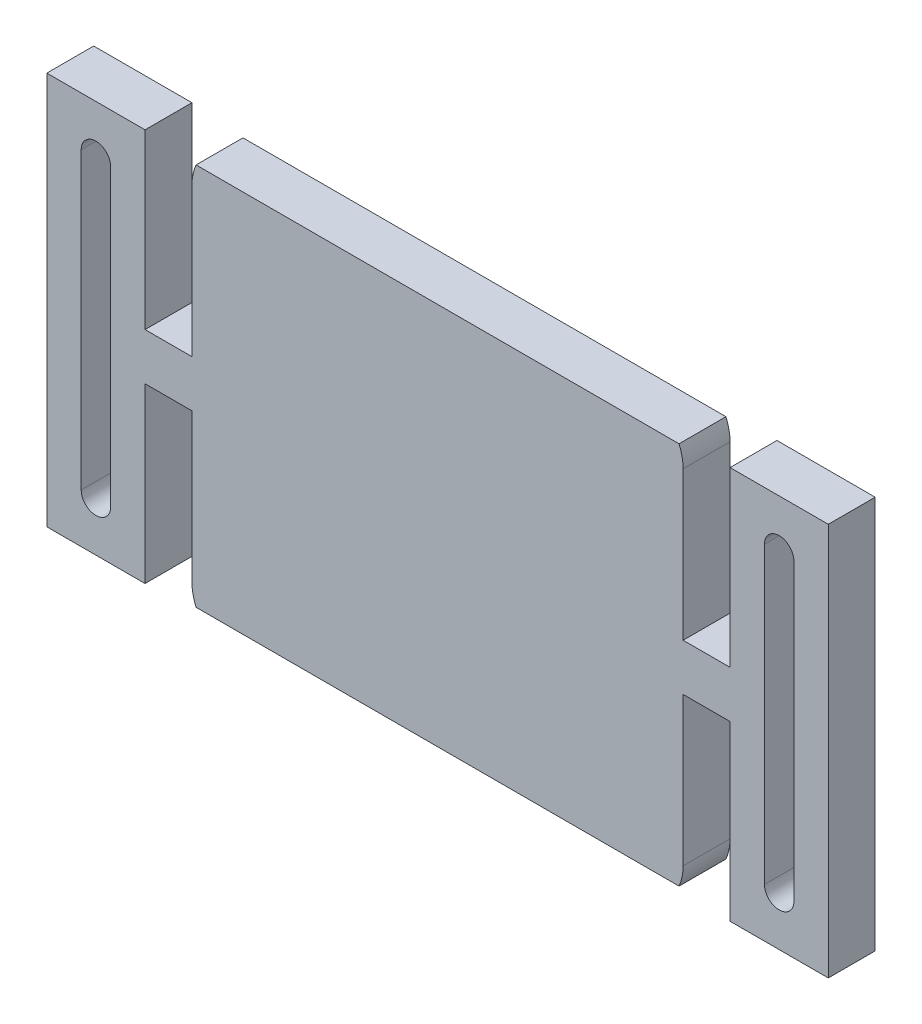
ISO-10303-21;
HEADER;
FILE_DESCRIPTION(('STEP AP214'),'2;1');
FILE_NAME('part.step','',(''),(''),'','','');
FILE_SCHEMA(('AUTOMOTIVE_DESIGN { 1 0 10303 214 1 1 1 1 }'));
ENDSEC;
DATA;
#1=APPLICATION_CONTEXT('core data for automotive mechanical design processes');
#2=APPLICATION_PROTOCOL_DEFINITION('international standard','automotive_design',2000,#1);
#3=PRODUCT_CONTEXT('',#1,'mechanical');
#4=PRODUCT('Part','Part','',(#3));
#5=PRODUCT_RELATED_PRODUCT_CATEGORY('part','',(#4));
#6=PRODUCT_DEFINITION_FORMATION('','',#4);
#7=PRODUCT_DEFINITION_CONTEXT('part definition',#1,'design');
#8=PRODUCT_DEFINITION('design','',#6,#7);
#9=PRODUCT_DEFINITION_SHAPE('','',#8);
#10=(LENGTH_UNIT() NAMED_UNIT(*) SI_UNIT(.MILLI.,.METRE.));
#11=(NAMED_UNIT(*) PLANE_ANGLE_UNIT() SI_UNIT($,.RADIAN.));
#12=(NAMED_UNIT(*) SI_UNIT($,.STERADIAN.) SOLID_ANGLE_UNIT());
#13=UNCERTAINTY_MEASURE_WITH_UNIT(LENGTH_MEASURE(1.E-05),#10,'distance_accuracy_value','');
#14=(GEOMETRIC_REPRESENTATION_CONTEXT(3) GLOBAL_UNCERTAINTY_ASSIGNED_CONTEXT((#13)) GLOBAL_UNIT_ASSIGNED_CONTEXT((#10,
#11,#12)) REPRESENTATION_CONTEXT('',''));
#15=CARTESIAN_POINT('',(0.,0.,0.));
#16=DIRECTION('',(0.,0.,1.));
#17=DIRECTION('',(1.,0.,0.));
#18=AXIS2_PLACEMENT_3D('',#15,#16,#17);
#19=CARTESIAN_POINT('',(0.,0.,0.));
#20=DIRECTION('',(0.,0.,1.));
#21=DIRECTION('',(1.,0.,0.));
#22=AXIS2_PLACEMENT_3D('',#19,#20,#21);
#23=PLANE('',#22);
#24=DIRECTION('',(1.,0.,0.));
#25=VECTOR('',#24,1.);
#26=CARTESIAN_POINT('',(0.,42.,0.));
#27=LINE('',#26,#25);
#28=CARTESIAN_POINT('',(-54.3577756949558,42.,0.));
#29=VERTEX_POINT('',#28);
#30=CARTESIAN_POINT('',(-5.19262430504416,42.,0.));
#31=VERTEX_POINT('',#30);
#32=EDGE_CURVE('E480',#29,#31,#27,.T.);
#33=ORIENTED_EDGE('',*,*,#32,.T.);
#34=CARTESIAN_POINT('',(-9.7752,40.,0.));
#35=DIRECTION('',(0.,0.,1.));
#36=DIRECTION('',(1.,0.,0.));
#37=AXIS2_PLACEMENT_3D('',#34,#35,#36);
#38=CIRCLE('',#37,5.);
#39=CARTESIAN_POINT('',(-4.7752,40.,0.));
#40=VERTEX_POINT('',#39);
#41=EDGE_CURVE('E494',#40,#31,#38,.T.);
#42=ORIENTED_EDGE('',*,*,#41,.F.);
#43=DIRECTION('',(0.,-1.,0.));
#44=VECTOR('',#43,1.);
#45=CARTESIAN_POINT('',(-4.7752,0.,0.));
#46=LINE('',#45,#44);
#47=CARTESIAN_POINT('',(-4.7752,24.8875999999999,0.));
#48=VERTEX_POINT('',#47);
#49=EDGE_CURVE('E504',#40,#48,#46,.T.);
#50=ORIENTED_EDGE('',*,*,#49,.T.);
#51=DIRECTION('',(1.,0.,0.));
#52=VECTOR('',#51,1.);
#53=CARTESIAN_POINT('',(-4.7752,24.8875999999999,0.));
#54=LINE('',#53,#52);
#55=CARTESIAN_POINT('',(0.,24.8875999999999,0.));
#56=VERTEX_POINT('',#55);
#57=EDGE_CURVE('E577',#48,#56,#54,.T.);
#58=ORIENTED_EDGE('',*,*,#57,.T.);
#59=DIRECTION('',(0.,1.,0.));
#60=VECTOR('',#59,1.);
#61=CARTESIAN_POINT('',(0.,2.49999999999995,0.));
#62=LINE('',#61,#60);
#63=CARTESIAN_POINT('',(0.,42.4999999999999,0.));
#64=VERTEX_POINT('',#63);
#65=EDGE_CURVE('E617',#56,#64,#62,.T.);
#66=ORIENTED_EDGE('',*,*,#65,.T.);
#67=DIRECTION('',(1.,0.,0.));
#68=VECTOR('',#67,1.);
#69=CARTESIAN_POINT('',(0.,42.4999999999999,0.));
#70=LINE('',#69,#68);
#71=CARTESIAN_POINT('',(10.,42.4999999999999,0.));
#72=VERTEX_POINT('',#71);
#73=EDGE_CURVE('E613',#64,#72,#70,.T.);
#74=ORIENTED_EDGE('',*,*,#73,.T.);
#75=DIRECTION('',(0.,1.,0.));
#76=VECTOR('',#75,1.);
#77=CARTESIAN_POINT('',(9.99999999999997,2.49999999999993,0.));
#78=LINE('',#77,#76);
#79=CARTESIAN_POINT('',(9.99999999999997,2.49999999999993,0.));
#80=VERTEX_POINT('',#79);
#81=EDGE_CURVE('E609',#80,#72,#78,.T.);
#82=ORIENTED_EDGE('',*,*,#81,.F.);
#83=DIRECTION('',(-1.,0.,0.));
#84=VECTOR('',#83,1.);
#85=CARTESIAN_POINT('',(4.99999999999996,2.49999999999995,0.));
#86=LINE('',#85,#84);
#87=CARTESIAN_POINT('',(0.,2.49999999999995,0.));
#88=VERTEX_POINT('',#87);
#89=EDGE_CURVE('E596',#80,#88,#86,.T.);
#90=ORIENTED_EDGE('',*,*,#89,.T.);
#91=CARTESIAN_POINT('',(0.,20.1123999999999,0.));
#92=VERTEX_POINT('',#91);
#93=EDGE_CURVE('E618',#88,#92,#62,.T.);
#94=ORIENTED_EDGE('',*,*,#93,.T.);
#95=DIRECTION('',(1.,0.,0.));
#96=VECTOR('',#95,1.);
#97=CARTESIAN_POINT('',(-4.7752,20.1123999999999,0.));
#98=LINE('',#97,#96);
#99=CARTESIAN_POINT('',(-4.7752,20.1123999999999,0.));
#100=VERTEX_POINT('',#99);
#101=EDGE_CURVE('E572',#100,#92,#98,.T.);
#102=ORIENTED_EDGE('',*,*,#101,.F.);
#103=CARTESIAN_POINT('',(-4.7752,5.00000000000006,0.));
#104=VERTEX_POINT('',#103);
#105=EDGE_CURVE('E510',#100,#104,#46,.T.);
#106=ORIENTED_EDGE('',*,*,#105,.T.);
#107=CARTESIAN_POINT('',(-9.7752,5.00000000000003,0.));
#108=DIRECTION('',(0.,0.,1.));
#109=DIRECTION('',(1.,0.,0.));
#110=AXIS2_PLACEMENT_3D('',#107,#108,#109);
#111=CIRCLE('',#110,5.);
#112=CARTESIAN_POINT('',(-5.19262430504425,2.99999999999982,0.));
#113=VERTEX_POINT('',#112);
#114=EDGE_CURVE('E559',#113,#104,#111,.T.);
#115=ORIENTED_EDGE('',*,*,#114,.F.);
#116=DIRECTION('',(1.,0.,0.));
#117=VECTOR('',#116,1.);
#118=CARTESIAN_POINT('',(0.,2.99999999999981,0.));
#119=LINE('',#118,#117);
#120=CARTESIAN_POINT('',(-54.3577756949559,2.99999999999987,0.));
#121=VERTEX_POINT('',#120);
#122=EDGE_CURVE('E287',#121,#113,#119,.T.);
#123=ORIENTED_EDGE('',*,*,#122,.F.);
#124=CARTESIAN_POINT('',(-49.7752,5.00000000000003,0.));
#125=DIRECTION('',(0.,0.,1.));
#126=DIRECTION('',(1.,0.,0.));
#127=AXIS2_PLACEMENT_3D('',#124,#125,#126);
#128=CIRCLE('',#127,5.);
#129=CARTESIAN_POINT('',(-54.7752,5.00000000000003,0.));
#130=VERTEX_POINT('',#129);
#131=EDGE_CURVE('E518',#130,#121,#128,.T.);
#132=ORIENTED_EDGE('',*,*,#131,.F.);
#133=DIRECTION('',(0.,1.,0.));
#134=VECTOR('',#133,1.);
#135=CARTESIAN_POINT('',(-54.7752,0.,0.));
#136=LINE('',#135,#134);
#137=CARTESIAN_POINT('',(-54.7752,20.1123999999999,0.));
#138=VERTEX_POINT('',#137);
#139=EDGE_CURVE('E514',#130,#138,#136,.T.);
#140=ORIENTED_EDGE('',*,*,#139,.T.);
#141=DIRECTION('',(1.,0.,0.));
#142=VECTOR('',#141,1.);
#143=CARTESIAN_POINT('',(-59.5504,20.1123999999999,0.));
#144=LINE('',#143,#142);
#145=CARTESIAN_POINT('',(-59.5504,20.1123999999999,0.));
#146=VERTEX_POINT('',#145);
#147=EDGE_CURVE('E543',#146,#138,#144,.T.);
#148=ORIENTED_EDGE('',*,*,#147,.F.);
#149=DIRECTION('',(0.,1.,0.));
#150=VECTOR('',#149,1.);
#151=CARTESIAN_POINT('',(-59.5504,2.49999999999995,0.));
#152=LINE('',#151,#150);
#153=CARTESIAN_POINT('',(-59.5504,2.49999999999995,0.));
#154=VERTEX_POINT('',#153);
#155=EDGE_CURVE('E665',#154,#146,#152,.T.);
#156=ORIENTED_EDGE('',*,*,#155,.F.);
#157=DIRECTION('',(1.,0.,0.));
#158=VECTOR('',#157,1.);
#159=CARTESIAN_POINT('',(-64.5504,2.49999999999995,0.));
#160=LINE('',#159,#158);
#161=CARTESIAN_POINT('',(-69.5504,2.49999999999995,0.));
#162=VERTEX_POINT('',#161);
#163=EDGE_CURVE('E643',#162,#154,#160,.T.);
#164=ORIENTED_EDGE('',*,*,#163,.F.);
#165=DIRECTION('',(0.,1.,0.));
#166=VECTOR('',#165,1.);
#167=CARTESIAN_POINT('',(-69.5504,2.49999999999995,0.));
#168=LINE('',#167,#166);
#169=CARTESIAN_POINT('',(-69.5504,42.5,0.));
#170=VERTEX_POINT('',#169);
#171=EDGE_CURVE('E656',#162,#170,#168,.T.);
#172=ORIENTED_EDGE('',*,*,#171,.T.);
#173=DIRECTION('',(-1.,0.,0.));
#174=VECTOR('',#173,1.);
#175=CARTESIAN_POINT('',(-59.5504,42.5,0.));
#176=LINE('',#175,#174);
#177=CARTESIAN_POINT('',(-59.5504,42.5,0.));
#178=VERTEX_POINT('',#177);
#179=EDGE_CURVE('E660',#178,#170,#176,.T.);
#180=ORIENTED_EDGE('',*,*,#179,.F.);
#181=CARTESIAN_POINT('',(-59.5504,24.8875999999999,0.));
#182=VERTEX_POINT('',#181);
#183=EDGE_CURVE('E664',#182,#178,#152,.T.);
#184=ORIENTED_EDGE('',*,*,#183,.F.);
#185=DIRECTION('',(1.,0.,0.));
#186=VECTOR('',#185,1.);
#187=CARTESIAN_POINT('',(-59.5504,24.8875999999999,0.));
#188=LINE('',#187,#186);
#189=CARTESIAN_POINT('',(-54.7752,24.8875999999999,0.));
#190=VERTEX_POINT('',#189);
#191=EDGE_CURVE('E548',#182,#190,#188,.T.);
#192=ORIENTED_EDGE('',*,*,#191,.T.);
#193=CARTESIAN_POINT('',(-54.7752,40.,0.));
#194=VERTEX_POINT('',#193);
#195=EDGE_CURVE('E508',#190,#194,#136,.T.);
#196=ORIENTED_EDGE('',*,*,#195,.T.);
#197=CARTESIAN_POINT('',(-49.7752,40.,0.));
#198=DIRECTION('',(0.,0.,1.));
#199=DIRECTION('',(1.,0.,0.));
#200=AXIS2_PLACEMENT_3D('',#197,#198,#199);
#201=CIRCLE('',#200,5.);
#202=EDGE_CURVE('E497',#29,#194,#201,.T.);
#203=ORIENTED_EDGE('',*,*,#202,.F.);
#204=EDGE_LOOP('',(#33,#42,#50,#58,#66,#74,#82,#90,#94,#102,#106,#115,#123,#132,#140,#148,#156,
#164,#172,#180,#184,#192,#196,#203));
#205=FACE_BOUND('',#204,.T.);
#206=DIRECTION('',(0.,-1.,0.));
#207=VECTOR('',#206,1.);
#208=CARTESIAN_POINT('',(-66.0504,0.,0.));
#209=LINE('',#208,#207);
#210=CARTESIAN_POINT('',(-66.0504,37.5,0.));
#211=VERTEX_POINT('',#210);
#212=CARTESIAN_POINT('',(-66.0504,7.49999999999994,0.));
#213=VERTEX_POINT('',#212);
#214=EDGE_CURVE('E808',#211,#213,#209,.T.);
#215=ORIENTED_EDGE('',*,*,#214,.T.);
#216=CARTESIAN_POINT('',(-64.5504,7.49999999999994,0.));
#217=DIRECTION('',(0.,0.,1.));
#218=DIRECTION('',(1.,0.,0.));
#219=AXIS2_PLACEMENT_3D('',#216,#217,#218);
#220=CIRCLE('',#219,1.5);
#221=CARTESIAN_POINT('',(-63.0504,7.49999999999994,0.));
#222=VERTEX_POINT('',#221);
#223=EDGE_CURVE('E804',#222,#213,#220,.F.);
#224=ORIENTED_EDGE('',*,*,#223,.F.);
#225=DIRECTION('',(0.,-1.,0.));
#226=VECTOR('',#225,1.);
#227=CARTESIAN_POINT('',(-63.0504,0.,0.));
#228=LINE('',#227,#226);
#229=CARTESIAN_POINT('',(-63.0504,37.5,0.));
#230=VERTEX_POINT('',#229);
#231=EDGE_CURVE('E800',#230,#222,#228,.T.);
#232=ORIENTED_EDGE('',*,*,#231,.F.);
#233=CARTESIAN_POINT('',(-64.5504,37.5,0.));
#234=DIRECTION('',(0.,0.,1.));
#235=DIRECTION('',(1.,0.,0.));
#236=AXIS2_PLACEMENT_3D('',#233,#234,#235);
#237=CIRCLE('',#236,1.5);
#238=EDGE_CURVE('E796',#230,#211,#237,.T.);
#239=ORIENTED_EDGE('',*,*,#238,.T.);
#240=EDGE_LOOP('',(#215,#224,#232,#239));
#241=FACE_BOUND('',#240,.T.);
#242=CARTESIAN_POINT('',(4.99999999999996,7.49999999999994,0.));
#243=DIRECTION('',(0.,0.,1.));
#244=DIRECTION('',(1.,0.,0.));
#245=AXIS2_PLACEMENT_3D('',#242,#243,#244);
#246=CIRCLE('',#245,1.49999999999998);
#247=CARTESIAN_POINT('',(3.49999999999997,7.49999999999994,0.));
#248=VERTEX_POINT('',#247);
#249=CARTESIAN_POINT('',(6.49999999999995,7.49999999999994,0.));
#250=VERTEX_POINT('',#249);
#251=EDGE_CURVE('E837',#248,#250,#246,.T.);
#252=ORIENTED_EDGE('',*,*,#251,.T.);
#253=DIRECTION('',(0.,-1.,0.));
#254=VECTOR('',#253,1.);
#255=CARTESIAN_POINT('',(6.49999999999996,0.,0.));
#256=LINE('',#255,#254);
#257=CARTESIAN_POINT('',(6.49999999999998,37.4999999999999,0.));
#258=VERTEX_POINT('',#257);
#259=EDGE_CURVE('E849',#258,#250,#256,.T.);
#260=ORIENTED_EDGE('',*,*,#259,.F.);
#261=CARTESIAN_POINT('',(4.99999999999999,37.4999999999999,0.));
#262=DIRECTION('',(0.,0.,1.));
#263=DIRECTION('',(1.,0.,0.));
#264=AXIS2_PLACEMENT_3D('',#261,#262,#263);
#265=CIRCLE('',#264,1.49999999999998);
#266=CARTESIAN_POINT('',(3.5,37.4999999999999,0.));
#267=VERTEX_POINT('',#266);
#268=EDGE_CURVE('E845',#267,#258,#265,.F.);
#269=ORIENTED_EDGE('',*,*,#268,.F.);
#270=DIRECTION('',(0.,-1.,0.));
#271=VECTOR('',#270,1.);
#272=CARTESIAN_POINT('',(3.49999999999995,0.,0.));
#273=LINE('',#272,#271);
#274=EDGE_CURVE('E841',#267,#248,#273,.T.);
#275=ORIENTED_EDGE('',*,*,#274,.T.);
#276=EDGE_LOOP('',(#252,#260,#269,#275));
#277=FACE_BOUND('',#276,.T.);
#278=ADVANCED_FACE('F269',(#205,#241,#277),#23,.F.);
#279=CARTESIAN_POINT('',(0.,0.,4.7752));
#280=DIRECTION('',(0.,0.,1.));
#281=DIRECTION('',(1.,0.,0.));
#282=AXIS2_PLACEMENT_3D('',#279,#280,#281);
#283=PLANE('',#282);
#284=DIRECTION('',(0.,-1.,0.));
#285=VECTOR('',#284,1.);
#286=CARTESIAN_POINT('',(6.49999999999996,0.,4.7752));
#287=LINE('',#286,#285);
#288=CARTESIAN_POINT('',(6.49999999999998,37.4999999999999,4.7752));
#289=VERTEX_POINT('',#288);
#290=CARTESIAN_POINT('',(6.49999999999996,7.49999999999994,4.7752));
#291=VERTEX_POINT('',#290);
#292=EDGE_CURVE('E833',#289,#291,#287,.T.);
#293=ORIENTED_EDGE('',*,*,#292,.T.);
#294=CARTESIAN_POINT('',(4.99999999999996,7.49999999999994,4.7752));
#295=DIRECTION('',(0.,0.,1.));
#296=DIRECTION('',(1.,0.,0.));
#297=AXIS2_PLACEMENT_3D('',#294,#295,#296);
#298=CIRCLE('',#297,1.49999999999998);
#299=CARTESIAN_POINT('',(3.49999999999998,7.49999999999994,4.7752));
#300=VERTEX_POINT('',#299);
#301=EDGE_CURVE('E822',#300,#291,#298,.T.);
#302=ORIENTED_EDGE('',*,*,#301,.F.);
#303=DIRECTION('',(0.,-1.,0.));
#304=VECTOR('',#303,1.);
#305=CARTESIAN_POINT('',(3.49999999999995,0.,4.7752));
#306=LINE('',#305,#304);
#307=CARTESIAN_POINT('',(3.5,37.4999999999999,4.7752));
#308=VERTEX_POINT('',#307);
#309=EDGE_CURVE('E825',#308,#300,#306,.T.);
#310=ORIENTED_EDGE('',*,*,#309,.F.);
#311=CARTESIAN_POINT('',(4.99999999999999,37.4999999999999,4.7752));
#312=DIRECTION('',(0.,0.,1.));
#313=DIRECTION('',(1.,0.,0.));
#314=AXIS2_PLACEMENT_3D('',#311,#312,#313);
#315=CIRCLE('',#314,1.49999999999998);
#316=EDGE_CURVE('E829',#308,#289,#315,.F.);
#317=ORIENTED_EDGE('',*,*,#316,.T.);
#318=EDGE_LOOP('',(#293,#302,#310,#317));
#319=FACE_BOUND('',#318,.T.);
#320=CARTESIAN_POINT('',(-64.5504,7.49999999999994,4.7752));
#321=DIRECTION('',(0.,0.,1.));
#322=DIRECTION('',(1.,0.,0.));
#323=AXIS2_PLACEMENT_3D('',#320,#321,#322);
#324=CIRCLE('',#323,1.5);
#325=CARTESIAN_POINT('',(-63.0504,7.49999999999994,4.7752));
#326=VERTEX_POINT('',#325);
#327=CARTESIAN_POINT('',(-66.0504,7.49999999999994,4.7752));
#328=VERTEX_POINT('',#327);
#329=EDGE_CURVE('E789',#326,#328,#324,.F.);
#330=ORIENTED_EDGE('',*,*,#329,.T.);
#331=DIRECTION('',(0.,-1.,0.));
#332=VECTOR('',#331,1.);
#333=CARTESIAN_POINT('',(-66.0504,0.,4.7752));
#334=LINE('',#333,#332);
#335=CARTESIAN_POINT('',(-66.0504,37.5,4.7752));
#336=VERTEX_POINT('',#335);
#337=EDGE_CURVE('E793',#336,#328,#334,.T.);
#338=ORIENTED_EDGE('',*,*,#337,.F.);
#339=CARTESIAN_POINT('',(-64.5504,37.5,4.7752));
#340=DIRECTION('',(0.,0.,1.));
#341=DIRECTION('',(1.,0.,0.));
#342=AXIS2_PLACEMENT_3D('',#339,#340,#341);
#343=CIRCLE('',#342,1.5);
#344=CARTESIAN_POINT('',(-63.0504,37.5,4.7752));
#345=VERTEX_POINT('',#344);
#346=EDGE_CURVE('E782',#345,#336,#343,.T.);
#347=ORIENTED_EDGE('',*,*,#346,.F.);
#348=DIRECTION('',(0.,-1.,0.));
#349=VECTOR('',#348,1.);
#350=CARTESIAN_POINT('',(-63.0504,0.,4.7752));
#351=LINE('',#350,#349);
#352=EDGE_CURVE('E785',#345,#326,#351,.T.);
#353=ORIENTED_EDGE('',*,*,#352,.T.);
#354=EDGE_LOOP('',(#330,#338,#347,#353));
#355=FACE_BOUND('',#354,.T.);
#356=CARTESIAN_POINT('',(-9.7752,40.,4.7752));
#357=DIRECTION('',(0.,0.,1.));
#358=DIRECTION('',(1.,0.,0.));
#359=AXIS2_PLACEMENT_3D('',#356,#357,#358);
#360=CIRCLE('',#359,5.);
#361=CARTESIAN_POINT('',(-4.7752,40.,4.7752));
#362=VERTEX_POINT('',#361);
#363=CARTESIAN_POINT('',(-5.19262430504416,42.,4.7752));
#364=VERTEX_POINT('',#363);
#365=EDGE_CURVE('E744',#362,#364,#360,.T.);
#366=ORIENTED_EDGE('',*,*,#365,.T.);
#367=DIRECTION('',(-1.,0.,0.));
#368=VECTOR('',#367,1.);
#369=CARTESIAN_POINT('',(0.,42.,4.7752));
#370=LINE('',#369,#368);
#371=CARTESIAN_POINT('',(-54.3577756949558,42.,4.7752));
#372=VERTEX_POINT('',#371);
#373=EDGE_CURVE('E295',#364,#372,#370,.T.);
#374=ORIENTED_EDGE('',*,*,#373,.T.);
#375=CARTESIAN_POINT('',(-49.7752,40.,4.7752));
#376=DIRECTION('',(0.,0.,1.));
#377=DIRECTION('',(1.,0.,0.));
#378=AXIS2_PLACEMENT_3D('',#375,#376,#377);
#379=CIRCLE('',#378,5.);
#380=CARTESIAN_POINT('',(-54.7752,40.,4.7752));
#381=VERTEX_POINT('',#380);
#382=EDGE_CURVE('E715',#372,#381,#379,.T.);
#383=ORIENTED_EDGE('',*,*,#382,.T.);
#384=DIRECTION('',(0.,1.,0.));
#385=VECTOR('',#384,1.);
#386=CARTESIAN_POINT('',(-54.7752,0.,4.7752));
#387=LINE('',#386,#385);
#388=CARTESIAN_POINT('',(-54.7752,24.8875999999999,4.7752));
#389=VERTEX_POINT('',#388);
#390=EDGE_CURVE('E709',#389,#381,#387,.T.);
#391=ORIENTED_EDGE('',*,*,#390,.F.);
#392=DIRECTION('',(1.,0.,0.));
#393=VECTOR('',#392,1.);
#394=CARTESIAN_POINT('',(-59.5504,24.8875999999999,4.7752));
#395=LINE('',#394,#393);
#396=CARTESIAN_POINT('',(-59.5504,24.8875999999999,4.7752));
#397=VERTEX_POINT('',#396);
#398=EDGE_CURVE('E538',#397,#389,#395,.T.);
#399=ORIENTED_EDGE('',*,*,#398,.F.);
#400=DIRECTION('',(0.,1.,0.));
#401=VECTOR('',#400,1.);
#402=CARTESIAN_POINT('',(-59.5504,2.49999999999995,4.7752));
#403=LINE('',#402,#401);
#404=CARTESIAN_POINT('',(-59.5504,42.5,4.7752));
#405=VERTEX_POINT('',#404);
#406=EDGE_CURVE('E651',#397,#405,#403,.T.);
#407=ORIENTED_EDGE('',*,*,#406,.T.);
#408=DIRECTION('',(1.,0.,0.));
#409=VECTOR('',#408,1.);
#410=CARTESIAN_POINT('',(-69.5504,42.5,4.7752));
#411=LINE('',#410,#409);
#412=CARTESIAN_POINT('',(-69.5504,42.5,4.7752));
#413=VERTEX_POINT('',#412);
#414=EDGE_CURVE('E647',#413,#405,#411,.T.);
#415=ORIENTED_EDGE('',*,*,#414,.F.);
#416=DIRECTION('',(0.,1.,0.));
#417=VECTOR('',#416,1.);
#418=CARTESIAN_POINT('',(-69.5504,2.49999999999995,4.7752));
#419=LINE('',#418,#417);
#420=CARTESIAN_POINT('',(-69.5504,2.49999999999995,4.7752));
#421=VERTEX_POINT('',#420);
#422=EDGE_CURVE('E642',#421,#413,#419,.T.);
#423=ORIENTED_EDGE('',*,*,#422,.F.);
#424=DIRECTION('',(-1.,0.,0.));
#425=VECTOR('',#424,1.);
#426=CARTESIAN_POINT('',(-64.5504,2.49999999999995,4.7752));
#427=LINE('',#426,#425);
#428=CARTESIAN_POINT('',(-59.5504,2.49999999999995,4.7752));
#429=VERTEX_POINT('',#428);
#430=EDGE_CURVE('E638',#429,#421,#427,.T.);
#431=ORIENTED_EDGE('',*,*,#430,.F.);
#432=CARTESIAN_POINT('',(-59.5504,20.1123999999999,4.7752));
#433=VERTEX_POINT('',#432);
#434=EDGE_CURVE('E652',#429,#433,#403,.T.);
#435=ORIENTED_EDGE('',*,*,#434,.T.);
#436=DIRECTION('',(1.,0.,0.));
#437=VECTOR('',#436,1.);
#438=CARTESIAN_POINT('',(-59.5504,20.1123999999999,4.7752));
#439=LINE('',#438,#437);
#440=CARTESIAN_POINT('',(-54.7752,20.1123999999999,4.7752));
#441=VERTEX_POINT('',#440);
#442=EDGE_CURVE('E542',#433,#441,#439,.T.);
#443=ORIENTED_EDGE('',*,*,#442,.T.);
#444=CARTESIAN_POINT('',(-54.7752,5.00000000000003,4.7752));
#445=VERTEX_POINT('',#444);
#446=EDGE_CURVE('E705',#445,#441,#387,.T.);
#447=ORIENTED_EDGE('',*,*,#446,.F.);
#448=CARTESIAN_POINT('',(-49.7752,5.00000000000003,4.7752));
#449=DIRECTION('',(0.,0.,1.));
#450=DIRECTION('',(1.,0.,0.));
#451=AXIS2_PLACEMENT_3D('',#448,#449,#450);
#452=CIRCLE('',#451,5.);
#453=CARTESIAN_POINT('',(-54.3577756949559,2.99999999999987,4.7752));
#454=VERTEX_POINT('',#453);
#455=EDGE_CURVE('E527',#445,#454,#452,.T.);
#456=ORIENTED_EDGE('',*,*,#455,.T.);
#457=DIRECTION('',(-1.,0.,0.));
#458=VECTOR('',#457,1.);
#459=CARTESIAN_POINT('',(0.,2.99999999999981,4.7752));
#460=LINE('',#459,#458);
#461=CARTESIAN_POINT('',(-5.19262430504417,2.99999999999982,4.7752));
#462=VERTEX_POINT('',#461);
#463=EDGE_CURVE('E852',#462,#454,#460,.T.);
#464=ORIENTED_EDGE('',*,*,#463,.F.);
#465=CARTESIAN_POINT('',(-9.7752,5.00000000000003,4.7752));
#466=DIRECTION('',(0.,0.,1.));
#467=DIRECTION('',(1.,0.,0.));
#468=AXIS2_PLACEMENT_3D('',#465,#466,#467);
#469=CIRCLE('',#468,5.);
#470=CARTESIAN_POINT('',(-4.7752,5.00000000000006,4.7752));
#471=VERTEX_POINT('',#470);
#472=EDGE_CURVE('E522',#462,#471,#469,.T.);
#473=ORIENTED_EDGE('',*,*,#472,.T.);
#474=DIRECTION('',(0.,-1.,0.));
#475=VECTOR('',#474,1.);
#476=CARTESIAN_POINT('',(-4.7752,0.,4.7752));
#477=LINE('',#476,#475);
#478=CARTESIAN_POINT('',(-4.7752,20.1123999999999,4.7752));
#479=VERTEX_POINT('',#478);
#480=EDGE_CURVE('E730',#479,#471,#477,.T.);
#481=ORIENTED_EDGE('',*,*,#480,.F.);
#482=DIRECTION('',(1.,0.,0.));
#483=VECTOR('',#482,1.);
#484=CARTESIAN_POINT('',(-4.7752,20.1123999999999,4.7752));
#485=LINE('',#484,#483);
#486=CARTESIAN_POINT('',(0.,20.1123999999999,4.7752));
#487=VERTEX_POINT('',#486);
#488=EDGE_CURVE('E571',#479,#487,#485,.T.);
#489=ORIENTED_EDGE('',*,*,#488,.T.);
#490=DIRECTION('',(0.,1.,0.));
#491=VECTOR('',#490,1.);
#492=CARTESIAN_POINT('',(0.,2.49999999999995,4.7752));
#493=LINE('',#492,#491);
#494=CARTESIAN_POINT('',(0.,2.49999999999995,4.7752));
#495=VERTEX_POINT('',#494);
#496=EDGE_CURVE('E604',#495,#487,#493,.T.);
#497=ORIENTED_EDGE('',*,*,#496,.F.);
#498=DIRECTION('',(1.,0.,0.));
#499=VECTOR('',#498,1.);
#500=CARTESIAN_POINT('',(4.99999999999996,2.49999999999995,4.7752));
#501=LINE('',#500,#499);
#502=CARTESIAN_POINT('',(9.99999999999997,2.49999999999993,4.7752));
#503=VERTEX_POINT('',#502);
#504=EDGE_CURVE('E591',#495,#503,#501,.T.);
#505=ORIENTED_EDGE('',*,*,#504,.T.);
#506=DIRECTION('',(0.,1.,0.));
#507=VECTOR('',#506,1.);
#508=CARTESIAN_POINT('',(9.99999999999997,2.49999999999993,4.7752));
#509=LINE('',#508,#507);
#510=CARTESIAN_POINT('',(10.,42.4999999999999,4.7752));
#511=VERTEX_POINT('',#510);
#512=EDGE_CURVE('E595',#503,#511,#509,.T.);
#513=ORIENTED_EDGE('',*,*,#512,.T.);
#514=DIRECTION('',(-1.,0.,0.));
#515=VECTOR('',#514,1.);
#516=CARTESIAN_POINT('',(10.,42.4999999999999,4.7752));
#517=LINE('',#516,#515);
#518=CARTESIAN_POINT('',(0.,42.4999999999999,4.7752));
#519=VERTEX_POINT('',#518);
#520=EDGE_CURVE('E599',#511,#519,#517,.T.);
#521=ORIENTED_EDGE('',*,*,#520,.T.);
#522=CARTESIAN_POINT('',(0.,24.8875999999999,4.7752));
#523=VERTEX_POINT('',#522);
#524=EDGE_CURVE('E603',#523,#519,#493,.T.);
#525=ORIENTED_EDGE('',*,*,#524,.F.);
#526=DIRECTION('',(1.,0.,0.));
#527=VECTOR('',#526,1.);
#528=CARTESIAN_POINT('',(-4.7752,24.8875999999999,4.7752));
#529=LINE('',#528,#527);
#530=CARTESIAN_POINT('',(-4.7752,24.8875999999999,4.7752));
#531=VERTEX_POINT('',#530);
#532=EDGE_CURVE('E567',#531,#523,#529,.T.);
#533=ORIENTED_EDGE('',*,*,#532,.F.);
#534=EDGE_CURVE('E737',#362,#531,#477,.T.);
#535=ORIENTED_EDGE('',*,*,#534,.F.);
#536=EDGE_LOOP('',(#366,#374,#383,#391,#399,#407,#415,#423,#431,#435,#443,#447,#456,#464,#473,
#481,#489,#497,#505,#513,#521,#525,#533,#535));
#537=FACE_BOUND('',#536,.T.);
#538=ADVANCED_FACE('F697',(#319,#355,#537),#283,.T.);
#539=CARTESIAN_POINT('',(-49.7752,40.,4.7752));
#540=DIRECTION('',(0.,0.,-1.));
#541=DIRECTION('',(-1.,0.,0.));
#542=AXIS2_PLACEMENT_3D('',#539,#540,#541);
#543=CYLINDRICAL_SURFACE('',#542,5.);
#544=DIRECTION('',(0.,0.,-1.));
#545=VECTOR('',#544,1.);
#546=CARTESIAN_POINT('',(-54.3577756949558,42.,10.));
#547=LINE('',#546,#545);
#548=EDGE_CURVE('E487',#372,#29,#547,.T.);
#549=ORIENTED_EDGE('',*,*,#548,.T.);
#550=ORIENTED_EDGE('',*,*,#202,.T.);
#551=DIRECTION('',(0.,0.,-1.));
#552=VECTOR('',#551,1.);
#553=CARTESIAN_POINT('',(-54.7752,40.,4.7752));
#554=LINE('',#553,#552);
#555=EDGE_CURVE('E526',#381,#194,#554,.T.);
#556=ORIENTED_EDGE('',*,*,#555,.F.);
#557=ORIENTED_EDGE('',*,*,#382,.F.);
#558=EDGE_LOOP('',(#549,#550,#556,#557));
#559=FACE_BOUND('',#558,.T.);
#560=ADVANCED_FACE('F756',(#559),#543,.T.);
#561=CARTESIAN_POINT('',(-9.7752,40.,4.7752));
#562=DIRECTION('',(0.,0.,-1.));
#563=DIRECTION('',(-1.,0.,0.));
#564=AXIS2_PLACEMENT_3D('',#561,#562,#563);
#565=CYLINDRICAL_SURFACE('',#564,5.);
#566=DIRECTION('',(0.,0.,-1.));
#567=VECTOR('',#566,1.);
#568=CARTESIAN_POINT('',(-5.19262430504416,42.,10.));
#569=LINE('',#568,#567);
#570=EDGE_CURVE('E477',#364,#31,#569,.T.);
#571=ORIENTED_EDGE('',*,*,#570,.F.);
#572=ORIENTED_EDGE('',*,*,#365,.F.);
#573=DIRECTION('',(0.,0.,-1.));
#574=VECTOR('',#573,1.);
#575=CARTESIAN_POINT('',(-4.7752,40.,4.7752));
#576=LINE('',#575,#574);
#577=EDGE_CURVE('E502',#362,#40,#576,.T.);
#578=ORIENTED_EDGE('',*,*,#577,.T.);
#579=ORIENTED_EDGE('',*,*,#41,.T.);
#580=EDGE_LOOP('',(#571,#572,#578,#579));
#581=FACE_BOUND('',#580,.T.);
#582=ADVANCED_FACE('F501',(#581),#565,.T.);
#583=CARTESIAN_POINT('',(-54.7752,0.,4.7752));
#584=DIRECTION('',(-1.,0.,0.));
#585=DIRECTION('',(0.,0.,1.));
#586=AXIS2_PLACEMENT_3D('',#583,#584,#585);
#587=PLANE('',#586);
#588=DIRECTION('',(0.,0.,-1.));
#589=VECTOR('',#588,1.);
#590=CARTESIAN_POINT('',(-54.7752,24.8875999999999,4.7752));
#591=LINE('',#590,#589);
#592=EDGE_CURVE('E562',#389,#190,#591,.T.);
#593=ORIENTED_EDGE('',*,*,#592,.F.);
#594=ORIENTED_EDGE('',*,*,#390,.T.);
#595=ORIENTED_EDGE('',*,*,#555,.T.);
#596=ORIENTED_EDGE('',*,*,#195,.F.);
#597=EDGE_LOOP('',(#593,#594,#595,#596));
#598=FACE_BOUND('',#597,.T.);
#599=ADVANCED_FACE('F754',(#598),#587,.T.);
#600=CARTESIAN_POINT('',(-49.7752,5.00000000000003,4.7752));
#601=DIRECTION('',(0.,0.,-1.));
#602=DIRECTION('',(-1.,0.,0.));
#603=AXIS2_PLACEMENT_3D('',#600,#601,#602);
#604=CYLINDRICAL_SURFACE('',#603,5.);
#605=ORIENTED_EDGE('',*,*,#131,.T.);
#606=DIRECTION('',(0.,0.,-1.));
#607=VECTOR('',#606,1.);
#608=CARTESIAN_POINT('',(-54.3577756949559,2.99999999999987,10.));
#609=LINE('',#608,#607);
#610=EDGE_CURVE('E861',#454,#121,#609,.T.);
#611=ORIENTED_EDGE('',*,*,#610,.F.);
#612=ORIENTED_EDGE('',*,*,#455,.F.);
#613=DIRECTION('',(0.,0.,-1.));
#614=VECTOR('',#613,1.);
#615=CARTESIAN_POINT('',(-54.7752,5.00000000000003,4.7752));
#616=LINE('',#615,#614);
#617=EDGE_CURVE('E523',#445,#130,#616,.T.);
#618=ORIENTED_EDGE('',*,*,#617,.T.);
#619=EDGE_LOOP('',(#605,#611,#612,#618));
#620=FACE_BOUND('',#619,.T.);
#621=ADVANCED_FACE('F870',(#620),#604,.T.);
#622=CARTESIAN_POINT('',(-9.7752,5.00000000000003,4.7752));
#623=DIRECTION('',(0.,0.,-1.));
#624=DIRECTION('',(-1.,0.,0.));
#625=AXIS2_PLACEMENT_3D('',#622,#623,#624);
#626=CYLINDRICAL_SURFACE('',#625,5.);
#627=ORIENTED_EDGE('',*,*,#472,.F.);
#628=DIRECTION('',(0.,0.,-1.));
#629=VECTOR('',#628,1.);
#630=CARTESIAN_POINT('',(-5.19262430504417,2.99999999999982,10.));
#631=LINE('',#630,#629);
#632=EDGE_CURVE('E499',#462,#113,#631,.T.);
#633=ORIENTED_EDGE('',*,*,#632,.T.);
#634=ORIENTED_EDGE('',*,*,#114,.T.);
#635=DIRECTION('',(0.,0.,-1.));
#636=VECTOR('',#635,1.);
#637=CARTESIAN_POINT('',(-4.7752,5.00000000000006,4.7752));
#638=LINE('',#637,#636);
#639=EDGE_CURVE('E533',#471,#104,#638,.T.);
#640=ORIENTED_EDGE('',*,*,#639,.F.);
#641=EDGE_LOOP('',(#627,#633,#634,#640));
#642=FACE_BOUND('',#641,.T.);
#643=ADVANCED_FACE('F732',(#642),#626,.T.);
#644=CARTESIAN_POINT('',(-4.7752,0.,4.7752));
#645=DIRECTION('',(1.,0.,0.));
#646=DIRECTION('',(0.,0.,-1.));
#647=AXIS2_PLACEMENT_3D('',#644,#645,#646);
#648=PLANE('',#647);
#649=DIRECTION('',(0.,0.,-1.));
#650=VECTOR('',#649,1.);
#651=CARTESIAN_POINT('',(-4.7752,20.1123999999999,4.7752));
#652=LINE('',#651,#650);
#653=EDGE_CURVE('E12',#479,#100,#652,.T.);
#654=ORIENTED_EDGE('',*,*,#653,.F.);
#655=ORIENTED_EDGE('',*,*,#480,.T.);
#656=ORIENTED_EDGE('',*,*,#639,.T.);
#657=ORIENTED_EDGE('',*,*,#105,.F.);
#658=EDGE_LOOP('',(#654,#655,#656,#657));
#659=FACE_BOUND('',#658,.T.);
#660=ADVANCED_FACE('F728',(#659),#648,.T.);
#661=ORIENTED_EDGE('',*,*,#534,.T.);
#662=DIRECTION('',(0.,0.,-1.));
#663=VECTOR('',#662,1.);
#664=CARTESIAN_POINT('',(-4.7752,24.8875999999999,4.7752));
#665=LINE('',#664,#663);
#666=EDGE_CURVE('E279',#531,#48,#665,.T.);
#667=ORIENTED_EDGE('',*,*,#666,.T.);
#668=ORIENTED_EDGE('',*,*,#49,.F.);
#669=ORIENTED_EDGE('',*,*,#577,.F.);
#670=EDGE_LOOP('',(#661,#667,#668,#669));
#671=FACE_BOUND('',#670,.T.);
#672=ADVANCED_FACE('F1021',(#671),#648,.T.);
#673=ORIENTED_EDGE('',*,*,#446,.T.);
#674=DIRECTION('',(0.,0.,-1.));
#675=VECTOR('',#674,1.);
#676=CARTESIAN_POINT('',(-54.7752,20.1123999999999,4.7752));
#677=LINE('',#676,#675);
#678=EDGE_CURVE('E537',#441,#138,#677,.T.);
#679=ORIENTED_EDGE('',*,*,#678,.T.);
#680=ORIENTED_EDGE('',*,*,#139,.F.);
#681=ORIENTED_EDGE('',*,*,#617,.F.);
#682=EDGE_LOOP('',(#673,#679,#680,#681));
#683=FACE_BOUND('',#682,.T.);
#684=ADVANCED_FACE('F704',(#683),#587,.T.);
#685=CARTESIAN_POINT('',(-59.5504,42.5,4.7752));
#686=DIRECTION('',(0.,-1.,0.));
#687=DIRECTION('',(0.,0.,-1.));
#688=AXIS2_PLACEMENT_3D('',#685,#686,#687);
#689=PLANE('',#688);
#690=ORIENTED_EDGE('',*,*,#179,.T.);
#691=DIRECTION('',(0.,0.,-1.));
#692=VECTOR('',#691,1.);
#693=CARTESIAN_POINT('',(-69.5504,42.5,4.7752));
#694=LINE('',#693,#692);
#695=EDGE_CURVE('E677',#413,#170,#694,.T.);
#696=ORIENTED_EDGE('',*,*,#695,.F.);
#697=ORIENTED_EDGE('',*,*,#414,.T.);
#698=DIRECTION('',(0.,0.,-1.));
#699=VECTOR('',#698,1.);
#700=CARTESIAN_POINT('',(-59.5504,42.5,4.7752));
#701=LINE('',#700,#699);
#702=EDGE_CURVE('E674',#405,#178,#701,.T.);
#703=ORIENTED_EDGE('',*,*,#702,.T.);
#704=EDGE_LOOP('',(#690,#696,#697,#703));
#705=FACE_BOUND('',#704,.T.);
#706=ADVANCED_FACE('F767',(#705),#689,.F.);
#707=CARTESIAN_POINT('',(-69.5504,2.49999999999995,4.7752));
#708=DIRECTION('',(-1.,0.,0.));
#709=DIRECTION('',(0.,0.,1.));
#710=AXIS2_PLACEMENT_3D('',#707,#708,#709);
#711=PLANE('',#710);
#712=ORIENTED_EDGE('',*,*,#171,.F.);
#713=DIRECTION('',(0.,0.,-1.));
#714=VECTOR('',#713,1.);
#715=CARTESIAN_POINT('',(-69.5504,2.49999999999995,4.7752));
#716=LINE('',#715,#714);
#717=EDGE_CURVE('E273',#421,#162,#716,.T.);
#718=ORIENTED_EDGE('',*,*,#717,.F.);
#719=ORIENTED_EDGE('',*,*,#422,.T.);
#720=ORIENTED_EDGE('',*,*,#695,.T.);
#721=EDGE_LOOP('',(#712,#718,#719,#720));
#722=FACE_BOUND('',#721,.T.);
#723=ADVANCED_FACE('F271',(#722),#711,.T.);
#724=CARTESIAN_POINT('',(-64.5504,2.49999999999995,4.7752));
#725=DIRECTION('',(0.,1.,0.));
#726=DIRECTION('',(0.,0.,1.));
#727=AXIS2_PLACEMENT_3D('',#724,#725,#726);
#728=PLANE('',#727);
#729=ORIENTED_EDGE('',*,*,#163,.T.);
#730=DIRECTION('',(0.,0.,-1.));
#731=VECTOR('',#730,1.);
#732=CARTESIAN_POINT('',(-59.5504,2.49999999999995,4.7752));
#733=LINE('',#732,#731);
#734=EDGE_CURVE('E614',#429,#154,#733,.T.);
#735=ORIENTED_EDGE('',*,*,#734,.F.);
#736=ORIENTED_EDGE('',*,*,#430,.T.);
#737=ORIENTED_EDGE('',*,*,#717,.T.);
#738=EDGE_LOOP('',(#729,#735,#736,#737));
#739=FACE_BOUND('',#738,.T.);
#740=ADVANCED_FACE('F685',(#739),#728,.F.);
#741=CARTESIAN_POINT('',(-59.5504,2.49999999999995,4.7752));
#742=DIRECTION('',(-1.,0.,0.));
#743=DIRECTION('',(0.,0.,1.));
#744=AXIS2_PLACEMENT_3D('',#741,#742,#743);
#745=PLANE('',#744);
#746=ORIENTED_EDGE('',*,*,#406,.F.);
#747=DIRECTION('',(0.,0.,-1.));
#748=VECTOR('',#747,1.);
#749=CARTESIAN_POINT('',(-59.5504,24.8875999999999,4.7752));
#750=LINE('',#749,#748);
#751=EDGE_CURVE('E547',#397,#182,#750,.T.);
#752=ORIENTED_EDGE('',*,*,#751,.T.);
#753=ORIENTED_EDGE('',*,*,#183,.T.);
#754=ORIENTED_EDGE('',*,*,#702,.F.);
#755=EDGE_LOOP('',(#746,#752,#753,#754));
#756=FACE_BOUND('',#755,.T.);
#757=ADVANCED_FACE('F768',(#756),#745,.F.);
#758=DIRECTION('',(0.,0.,-1.));
#759=VECTOR('',#758,1.);
#760=CARTESIAN_POINT('',(-59.5504,20.1123999999999,4.7752));
#761=LINE('',#760,#759);
#762=EDGE_CURVE('E556',#433,#146,#761,.T.);
#763=ORIENTED_EDGE('',*,*,#762,.F.);
#764=ORIENTED_EDGE('',*,*,#434,.F.);
#765=ORIENTED_EDGE('',*,*,#734,.T.);
#766=ORIENTED_EDGE('',*,*,#155,.T.);
#767=EDGE_LOOP('',(#763,#764,#765,#766));
#768=FACE_BOUND('',#767,.T.);
#769=ADVANCED_FACE('F693',(#768),#745,.F.);
#770=CARTESIAN_POINT('',(-59.5504,20.1123999999999,4.7752));
#771=DIRECTION('',(0.,1.,0.));
#772=DIRECTION('',(0.,0.,1.));
#773=AXIS2_PLACEMENT_3D('',#770,#771,#772);
#774=PLANE('',#773);
#775=ORIENTED_EDGE('',*,*,#147,.T.);
#776=ORIENTED_EDGE('',*,*,#678,.F.);
#777=ORIENTED_EDGE('',*,*,#442,.F.);
#778=ORIENTED_EDGE('',*,*,#762,.T.);
#779=EDGE_LOOP('',(#775,#776,#777,#778));
#780=FACE_BOUND('',#779,.T.);
#781=ADVANCED_FACE('F701',(#780),#774,.F.);
#782=CARTESIAN_POINT('',(-59.5504,24.8875999999999,4.7752));
#783=DIRECTION('',(0.,1.,0.));
#784=DIRECTION('',(0.,0.,1.));
#785=AXIS2_PLACEMENT_3D('',#782,#783,#784);
#786=PLANE('',#785);
#787=ORIENTED_EDGE('',*,*,#191,.F.);
#788=ORIENTED_EDGE('',*,*,#751,.F.);
#789=ORIENTED_EDGE('',*,*,#398,.T.);
#790=ORIENTED_EDGE('',*,*,#592,.T.);
#791=EDGE_LOOP('',(#787,#788,#789,#790));
#792=FACE_BOUND('',#791,.T.);
#793=ADVANCED_FACE('F760',(#792),#786,.T.);
#794=CARTESIAN_POINT('',(0.,42.4999999999999,4.7752));
#795=DIRECTION('',(0.,1.,0.));
#796=DIRECTION('',(0.,0.,1.));
#797=AXIS2_PLACEMENT_3D('',#794,#795,#796);
#798=PLANE('',#797);
#799=ORIENTED_EDGE('',*,*,#73,.F.);
#800=DIRECTION('',(0.,0.,-1.));
#801=VECTOR('',#800,1.);
#802=CARTESIAN_POINT('',(0.,42.4999999999999,4.7752));
#803=LINE('',#802,#801);
#804=EDGE_CURVE('E627',#519,#64,#803,.T.);
#805=ORIENTED_EDGE('',*,*,#804,.F.);
#806=ORIENTED_EDGE('',*,*,#520,.F.);
#807=DIRECTION('',(0.,0.,-1.));
#808=VECTOR('',#807,1.);
#809=CARTESIAN_POINT('',(10.,42.4999999999999,4.7752));
#810=LINE('',#809,#808);
#811=EDGE_CURVE('E631',#511,#72,#810,.T.);
#812=ORIENTED_EDGE('',*,*,#811,.T.);
#813=EDGE_LOOP('',(#799,#805,#806,#812));
#814=FACE_BOUND('',#813,.T.);
#815=ADVANCED_FACE('F882',(#814),#798,.T.);
#816=CARTESIAN_POINT('',(4.99999999999996,2.49999999999995,4.7752));
#817=DIRECTION('',(0.,-1.,0.));
#818=DIRECTION('',(0.,0.,-1.));
#819=AXIS2_PLACEMENT_3D('',#816,#817,#818);
#820=PLANE('',#819);
#821=ORIENTED_EDGE('',*,*,#89,.F.);
#822=DIRECTION('',(0.,0.,-1.));
#823=VECTOR('',#822,1.);
#824=CARTESIAN_POINT('',(9.99999999999997,2.49999999999993,4.7752));
#825=LINE('',#824,#823);
#826=EDGE_CURVE('E581',#503,#80,#825,.T.);
#827=ORIENTED_EDGE('',*,*,#826,.F.);
#828=ORIENTED_EDGE('',*,*,#504,.F.);
#829=DIRECTION('',(0.,0.,-1.));
#830=VECTOR('',#829,1.);
#831=CARTESIAN_POINT('',(0.,2.49999999999995,4.7752));
#832=LINE('',#831,#830);
#833=EDGE_CURVE('E608',#495,#88,#832,.T.);
#834=ORIENTED_EDGE('',*,*,#833,.T.);
#835=EDGE_LOOP('',(#821,#827,#828,#834));
#836=FACE_BOUND('',#835,.T.);
#837=ADVANCED_FACE('F1054',(#836),#820,.T.);
#838=CARTESIAN_POINT('',(9.99999999999997,2.49999999999993,4.7752));
#839=DIRECTION('',(-1.,0.,0.));
#840=DIRECTION('',(0.,-1.,0.));
#841=AXIS2_PLACEMENT_3D('',#838,#839,#840);
#842=PLANE('',#841);
#843=ORIENTED_EDGE('',*,*,#81,.T.);
#844=ORIENTED_EDGE('',*,*,#811,.F.);
#845=ORIENTED_EDGE('',*,*,#512,.F.);
#846=ORIENTED_EDGE('',*,*,#826,.T.);
#847=EDGE_LOOP('',(#843,#844,#845,#846));
#848=FACE_BOUND('',#847,.T.);
#849=ADVANCED_FACE('F1046',(#848),#842,.F.);
#850=CARTESIAN_POINT('',(0.,2.49999999999995,4.7752));
#851=DIRECTION('',(-1.,0.,0.));
#852=DIRECTION('',(0.,-1.,0.));
#853=AXIS2_PLACEMENT_3D('',#850,#851,#852);
#854=PLANE('',#853);
#855=ORIENTED_EDGE('',*,*,#496,.T.);
#856=DIRECTION('',(0.,0.,-1.));
#857=VECTOR('',#856,1.);
#858=CARTESIAN_POINT('',(0.,20.1123999999999,4.7752));
#859=LINE('',#858,#857);
#860=EDGE_CURVE('E552',#487,#92,#859,.T.);
#861=ORIENTED_EDGE('',*,*,#860,.T.);
#862=ORIENTED_EDGE('',*,*,#93,.F.);
#863=ORIENTED_EDGE('',*,*,#833,.F.);
#864=EDGE_LOOP('',(#855,#861,#862,#863));
#865=FACE_BOUND('',#864,.T.);
#866=ADVANCED_FACE('F1037',(#865),#854,.T.);
#867=ORIENTED_EDGE('',*,*,#65,.F.);
#868=DIRECTION('',(0.,0.,-1.));
#869=VECTOR('',#868,1.);
#870=CARTESIAN_POINT('',(0.,24.8875999999999,4.7752));
#871=LINE('',#870,#869);
#872=EDGE_CURVE('E576',#523,#56,#871,.T.);
#873=ORIENTED_EDGE('',*,*,#872,.F.);
#874=ORIENTED_EDGE('',*,*,#524,.T.);
#875=ORIENTED_EDGE('',*,*,#804,.T.);
#876=EDGE_LOOP('',(#867,#873,#874,#875));
#877=FACE_BOUND('',#876,.T.);
#878=ADVANCED_FACE('F1028',(#877),#854,.T.);
#879=CARTESIAN_POINT('',(-4.7752,20.1123999999999,4.7752));
#880=DIRECTION('',(0.,1.,0.));
#881=DIRECTION('',(0.,0.,1.));
#882=AXIS2_PLACEMENT_3D('',#879,#880,#881);
#883=PLANE('',#882);
#884=ORIENTED_EDGE('',*,*,#101,.T.);
#885=ORIENTED_EDGE('',*,*,#860,.F.);
#886=ORIENTED_EDGE('',*,*,#488,.F.);
#887=ORIENTED_EDGE('',*,*,#653,.T.);
#888=EDGE_LOOP('',(#884,#885,#886,#887));
#889=FACE_BOUND('',#888,.T.);
#890=ADVANCED_FACE('F1018',(#889),#883,.F.);
#891=CARTESIAN_POINT('',(-4.7752,24.8875999999999,4.7752));
#892=DIRECTION('',(0.,1.,0.));
#893=DIRECTION('',(0.,0.,1.));
#894=AXIS2_PLACEMENT_3D('',#891,#892,#893);
#895=PLANE('',#894);
#896=ORIENTED_EDGE('',*,*,#57,.F.);
#897=ORIENTED_EDGE('',*,*,#666,.F.);
#898=ORIENTED_EDGE('',*,*,#532,.T.);
#899=ORIENTED_EDGE('',*,*,#872,.T.);
#900=EDGE_LOOP('',(#896,#897,#898,#899));
#901=FACE_BOUND('',#900,.T.);
#902=ADVANCED_FACE('F896',(#901),#895,.T.);
#903=CARTESIAN_POINT('',(6.49999999999996,0.,4.7752));
#904=DIRECTION('',(1.,0.,0.));
#905=DIRECTION('',(0.,1.,0.));
#906=AXIS2_PLACEMENT_3D('',#903,#904,#905);
#907=PLANE('',#906);
#908=ORIENTED_EDGE('',*,*,#259,.T.);
#909=DIRECTION('',(0.,0.,-1.));
#910=VECTOR('',#909,1.);
#911=CARTESIAN_POINT('',(6.49999999999996,7.49999999999994,4.7752));
#912=LINE('',#911,#910);
#913=EDGE_CURVE('E818',#291,#250,#912,.T.);
#914=ORIENTED_EDGE('',*,*,#913,.F.);
#915=ORIENTED_EDGE('',*,*,#292,.F.);
#916=DIRECTION('',(0.,0.,-1.));
#917=VECTOR('',#916,1.);
#918=CARTESIAN_POINT('',(6.49999999999998,37.4999999999999,4.7752));
#919=LINE('',#918,#917);
#920=EDGE_CURVE('E740',#289,#258,#919,.T.);
#921=ORIENTED_EDGE('',*,*,#920,.T.);
#922=EDGE_LOOP('',(#908,#914,#915,#921));
#923=FACE_BOUND('',#922,.T.);
#924=ADVANCED_FACE('F892',(#923),#907,.F.);
#925=CARTESIAN_POINT('',(4.99999999999999,37.4999999999999,4.7752));
#926=DIRECTION('',(0.,0.,-1.));
#927=DIRECTION('',(-1.,0.,0.));
#928=AXIS2_PLACEMENT_3D('',#925,#926,#927);
#929=CYLINDRICAL_SURFACE('',#928,1.49999999999998);
#930=ORIENTED_EDGE('',*,*,#268,.T.);
#931=ORIENTED_EDGE('',*,*,#920,.F.);
#932=ORIENTED_EDGE('',*,*,#316,.F.);
#933=DIRECTION('',(0.,0.,-1.));
#934=VECTOR('',#933,1.);
#935=CARTESIAN_POINT('',(3.5,37.4999999999999,4.7752));
#936=LINE('',#935,#934);
#937=EDGE_CURVE('E814',#308,#267,#936,.T.);
#938=ORIENTED_EDGE('',*,*,#937,.T.);
#939=EDGE_LOOP('',(#930,#931,#932,#938));
#940=FACE_BOUND('',#939,.T.);
#941=ADVANCED_FACE('F895',(#940),#929,.F.);
#942=CARTESIAN_POINT('',(3.49999999999995,0.,4.7752));
#943=DIRECTION('',(1.,0.,0.));
#944=DIRECTION('',(0.,1.,0.));
#945=AXIS2_PLACEMENT_3D('',#942,#943,#944);
#946=PLANE('',#945);
#947=ORIENTED_EDGE('',*,*,#274,.F.);
#948=ORIENTED_EDGE('',*,*,#937,.F.);
#949=ORIENTED_EDGE('',*,*,#309,.T.);
#950=DIRECTION('',(0.,0.,-1.));
#951=VECTOR('',#950,1.);
#952=CARTESIAN_POINT('',(3.49999999999997,7.49999999999994,4.7752));
#953=LINE('',#952,#951);
#954=EDGE_CURVE('E816',#300,#248,#953,.T.);
#955=ORIENTED_EDGE('',*,*,#954,.T.);
#956=EDGE_LOOP('',(#947,#948,#949,#955));
#957=FACE_BOUND('',#956,.T.);
#958=ADVANCED_FACE('F900',(#957),#946,.T.);
#959=CARTESIAN_POINT('',(4.99999999999996,7.49999999999994,4.7752));
#960=DIRECTION('',(0.,0.,-1.));
#961=DIRECTION('',(-1.,0.,0.));
#962=AXIS2_PLACEMENT_3D('',#959,#960,#961);
#963=CYLINDRICAL_SURFACE('',#962,1.49999999999998);
#964=ORIENTED_EDGE('',*,*,#251,.F.);
#965=ORIENTED_EDGE('',*,*,#954,.F.);
#966=ORIENTED_EDGE('',*,*,#301,.T.);
#967=ORIENTED_EDGE('',*,*,#913,.T.);
#968=EDGE_LOOP('',(#964,#965,#966,#967));
#969=FACE_BOUND('',#968,.T.);
#970=ADVANCED_FACE('F904',(#969),#963,.F.);
#971=CARTESIAN_POINT('',(-66.0504,0.,4.7752));
#972=DIRECTION('',(1.,0.,0.));
#973=DIRECTION('',(0.,0.,-1.));
#974=AXIS2_PLACEMENT_3D('',#971,#972,#973);
#975=PLANE('',#974);
#976=ORIENTED_EDGE('',*,*,#214,.F.);
#977=DIRECTION('',(0.,0.,-1.));
#978=VECTOR('',#977,1.);
#979=CARTESIAN_POINT('',(-66.0504,37.5,4.7752));
#980=LINE('',#979,#978);
#981=EDGE_CURVE('E778',#336,#211,#980,.T.);
#982=ORIENTED_EDGE('',*,*,#981,.F.);
#983=ORIENTED_EDGE('',*,*,#337,.T.);
#984=DIRECTION('',(0.,0.,-1.));
#985=VECTOR('',#984,1.);
#986=CARTESIAN_POINT('',(-66.0504,7.49999999999994,4.7752));
#987=LINE('',#986,#985);
#988=EDGE_CURVE('E661',#328,#213,#987,.T.);
#989=ORIENTED_EDGE('',*,*,#988,.T.);
#990=EDGE_LOOP('',(#976,#982,#983,#989));
#991=FACE_BOUND('',#990,.T.);
#992=ADVANCED_FACE('F908',(#991),#975,.T.);
#993=CARTESIAN_POINT('',(-64.5504,7.49999999999994,4.7752));
#994=DIRECTION('',(0.,0.,-1.));
#995=DIRECTION('',(-1.,0.,0.));
#996=AXIS2_PLACEMENT_3D('',#993,#994,#995);
#997=CYLINDRICAL_SURFACE('',#996,1.5);
#998=ORIENTED_EDGE('',*,*,#223,.T.);
#999=ORIENTED_EDGE('',*,*,#988,.F.);
#1000=ORIENTED_EDGE('',*,*,#329,.F.);
#1001=DIRECTION('',(0.,0.,-1.));
#1002=VECTOR('',#1001,1.);
#1003=CARTESIAN_POINT('',(-63.0504,7.49999999999994,4.7752));
#1004=LINE('',#1003,#1002);
#1005=EDGE_CURVE('E772',#326,#222,#1004,.T.);
#1006=ORIENTED_EDGE('',*,*,#1005,.T.);
#1007=EDGE_LOOP('',(#998,#999,#1000,#1006));
#1008=FACE_BOUND('',#1007,.T.);
#1009=ADVANCED_FACE('F912',(#1008),#997,.F.);
#1010=CARTESIAN_POINT('',(-63.0504,0.,4.7752));
#1011=DIRECTION('',(1.,0.,0.));
#1012=DIRECTION('',(0.,0.,-1.));
#1013=AXIS2_PLACEMENT_3D('',#1010,#1011,#1012);
#1014=PLANE('',#1013);
#1015=ORIENTED_EDGE('',*,*,#231,.T.);
#1016=ORIENTED_EDGE('',*,*,#1005,.F.);
#1017=ORIENTED_EDGE('',*,*,#352,.F.);
#1018=DIRECTION('',(0.,0.,-1.));
#1019=VECTOR('',#1018,1.);
#1020=CARTESIAN_POINT('',(-63.0504,37.5,4.7752));
#1021=LINE('',#1020,#1019);
#1022=EDGE_CURVE('E775',#345,#230,#1021,.T.);
#1023=ORIENTED_EDGE('',*,*,#1022,.T.);
#1024=EDGE_LOOP('',(#1015,#1016,#1017,#1023));
#1025=FACE_BOUND('',#1024,.T.);
#1026=ADVANCED_FACE('F916',(#1025),#1014,.F.);
#1027=CARTESIAN_POINT('',(-64.5504,37.5,4.7752));
#1028=DIRECTION('',(0.,0.,-1.));
#1029=DIRECTION('',(-1.,0.,0.));
#1030=AXIS2_PLACEMENT_3D('',#1027,#1028,#1029);
#1031=CYLINDRICAL_SURFACE('',#1030,1.5);
#1032=ORIENTED_EDGE('',*,*,#238,.F.);
#1033=ORIENTED_EDGE('',*,*,#1022,.F.);
#1034=ORIENTED_EDGE('',*,*,#346,.T.);
#1035=ORIENTED_EDGE('',*,*,#981,.T.);
#1036=EDGE_LOOP('',(#1032,#1033,#1034,#1035));
#1037=FACE_BOUND('',#1036,.T.);
#1038=ADVANCED_FACE('F920',(#1037),#1031,.F.);
#1039=CARTESIAN_POINT('',(0.,42.,10.));
#1040=DIRECTION('',(0.,1.,0.));
#1041=DIRECTION('',(0.,0.,1.));
#1042=AXIS2_PLACEMENT_3D('',#1039,#1040,#1041);
#1043=PLANE('',#1042);
#1044=ORIENTED_EDGE('',*,*,#570,.T.);
#1045=ORIENTED_EDGE('',*,*,#32,.F.);
#1046=ORIENTED_EDGE('',*,*,#548,.F.);
#1047=ORIENTED_EDGE('',*,*,#373,.F.);
#1048=EDGE_LOOP('',(#1044,#1045,#1046,#1047));
#1049=FACE_BOUND('',#1048,.T.);
#1050=ADVANCED_FACE('F479',(#1049),#1043,.T.);
#1051=CARTESIAN_POINT('',(0.,2.99999999999981,10.));
#1052=DIRECTION('',(0.,1.,0.));
#1053=DIRECTION('',(-1.,0.,0.));
#1054=AXIS2_PLACEMENT_3D('',#1051,#1052,#1053);
#1055=PLANE('',#1054);
#1056=ORIENTED_EDGE('',*,*,#463,.T.);
#1057=ORIENTED_EDGE('',*,*,#610,.T.);
#1058=ORIENTED_EDGE('',*,*,#122,.T.);
#1059=ORIENTED_EDGE('',*,*,#632,.F.);
#1060=EDGE_LOOP('',(#1056,#1057,#1058,#1059));
#1061=FACE_BOUND('',#1060,.T.);
#1062=ADVANCED_FACE('F867',(#1061),#1055,.F.);
#1063=CLOSED_SHELL('',(#278,#538,#560,#582,#599,#621,#643,#660,#672,#684,#706,#723,#740,#757,
#769,#781,#793,#815,#837,#849,#866,#878,#890,#902,#924,#941,#958,#970,#992,#1009,#1026,#1038,
#1050,#1062));
#1064=MANIFOLD_SOLID_BREP('B2',#1063);
#1065=ADVANCED_BREP_SHAPE_REPRESENTATION('',(#18,#1064),#14);
#1066=SHAPE_DEFINITION_REPRESENTATION(#9,#1065);
ENDSEC;
END-ISO-10303-21;
